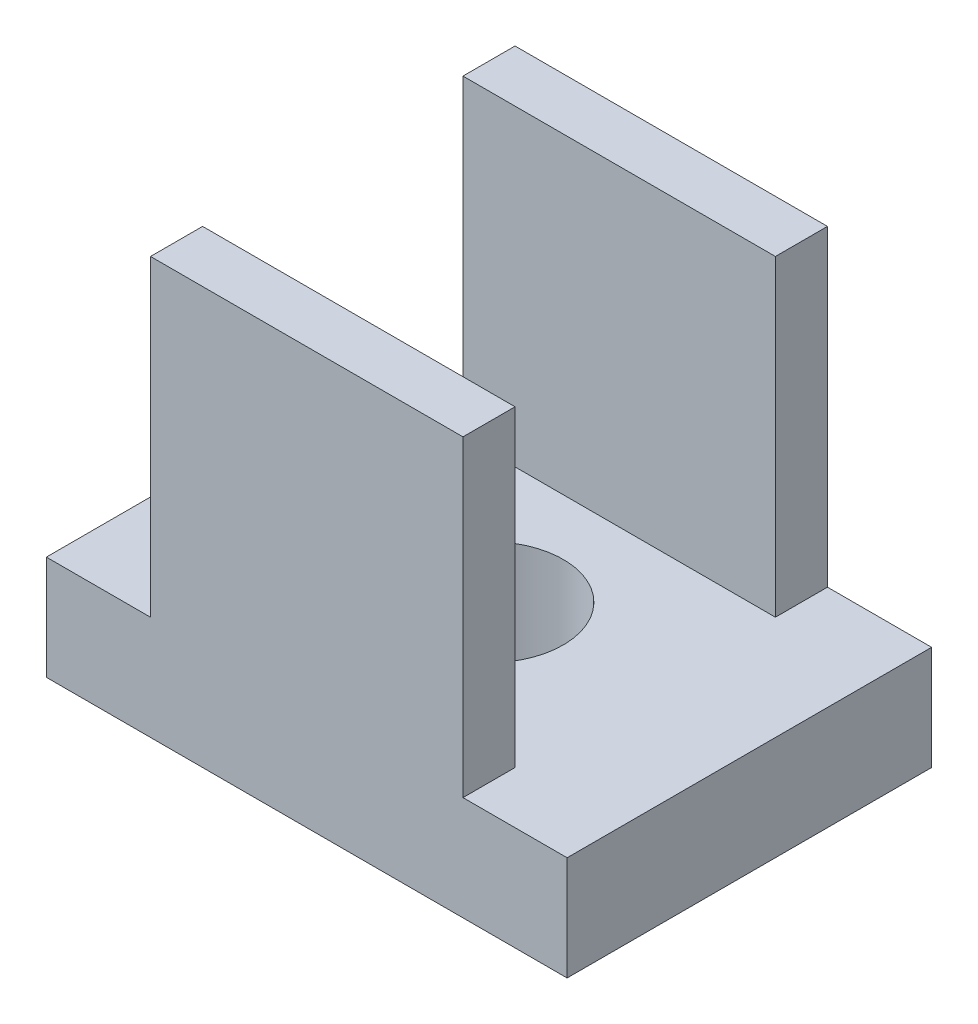
ISO-10303-21;
HEADER;
FILE_DESCRIPTION(('STEP AP214'),'2;1');
FILE_NAME('part.step','',(''),(''),'','','');
FILE_SCHEMA(('AUTOMOTIVE_DESIGN { 1 0 10303 214 1 1 1 1 }'));
ENDSEC;
DATA;
#1=APPLICATION_CONTEXT('core data for automotive mechanical design processes');
#2=APPLICATION_PROTOCOL_DEFINITION('international standard','automotive_design',2000,#1);
#3=PRODUCT_CONTEXT('',#1,'mechanical');
#4=PRODUCT('Part','Part','',(#3));
#5=PRODUCT_RELATED_PRODUCT_CATEGORY('part','',(#4));
#6=PRODUCT_DEFINITION_FORMATION('','',#4);
#7=PRODUCT_DEFINITION_CONTEXT('part definition',#1,'design');
#8=PRODUCT_DEFINITION('design','',#6,#7);
#9=PRODUCT_DEFINITION_SHAPE('','',#8);
#10=(LENGTH_UNIT() NAMED_UNIT(*) SI_UNIT(.MILLI.,.METRE.));
#11=(NAMED_UNIT(*) PLANE_ANGLE_UNIT() SI_UNIT($,.RADIAN.));
#12=(NAMED_UNIT(*) SI_UNIT($,.STERADIAN.) SOLID_ANGLE_UNIT());
#13=UNCERTAINTY_MEASURE_WITH_UNIT(LENGTH_MEASURE(1.E-05),#10,'distance_accuracy_value','');
#14=(GEOMETRIC_REPRESENTATION_CONTEXT(3) GLOBAL_UNCERTAINTY_ASSIGNED_CONTEXT((#13)) GLOBAL_UNIT_ASSIGNED_CONTEXT((#10,
#11,#12)) REPRESENTATION_CONTEXT('',''));
#15=CARTESIAN_POINT('',(0.,0.,0.));
#16=DIRECTION('',(0.,0.,1.));
#17=DIRECTION('',(1.,0.,0.));
#18=AXIS2_PLACEMENT_3D('',#15,#16,#17);
#19=CARTESIAN_POINT('',(0.,2.,0.));
#20=DIRECTION('',(0.,-1.,0.));
#21=DIRECTION('',(0.,0.,-1.));
#22=AXIS2_PLACEMENT_3D('',#19,#20,#21);
#23=PLANE('',#22);
#24=CARTESIAN_POINT('',(0.,2.,0.));
#25=DIRECTION('',(0.,1.,0.));
#26=DIRECTION('',(0.,0.,1.));
#27=AXIS2_PLACEMENT_3D('',#24,#25,#26);
#28=CIRCLE('',#27,1.425);
#29=CARTESIAN_POINT('',(0.,2.,1.425));
#30=VERTEX_POINT('',#29);
#31=EDGE_CURVE('E200',#30,#30,#28,.T.);
#32=ORIENTED_EDGE('',*,*,#31,.F.);
#33=EDGE_LOOP('',(#32));
#34=FACE_BOUND('',#33,.T.);
#35=DIRECTION('',(0.,0.,1.));
#36=VECTOR('',#35,1.);
#37=CARTESIAN_POINT('',(-3.,2.,3.5));
#38=LINE('',#37,#36);
#39=CARTESIAN_POINT('',(-3.,2.,2.5));
#40=VERTEX_POINT('',#39);
#41=CARTESIAN_POINT('',(-3.,2.,3.5));
#42=VERTEX_POINT('',#41);
#43=EDGE_CURVE('E55',#40,#42,#38,.T.);
#44=ORIENTED_EDGE('',*,*,#43,.F.);
#45=DIRECTION('',(-1.,0.,0.));
#46=VECTOR('',#45,1.);
#47=CARTESIAN_POINT('',(-3.,2.,2.5));
#48=LINE('',#47,#46);
#49=CARTESIAN_POINT('',(3.,2.,2.5));
#50=VERTEX_POINT('',#49);
#51=EDGE_CURVE('E59',#50,#40,#48,.T.);
#52=ORIENTED_EDGE('',*,*,#51,.F.);
#53=DIRECTION('',(0.,0.,-1.));
#54=VECTOR('',#53,1.);
#55=CARTESIAN_POINT('',(3.,2.,3.5));
#56=LINE('',#55,#54);
#57=CARTESIAN_POINT('',(3.,2.,3.5));
#58=VERTEX_POINT('',#57);
#59=EDGE_CURVE('E261',#58,#50,#56,.T.);
#60=ORIENTED_EDGE('',*,*,#59,.F.);
#61=DIRECTION('',(1.,0.,0.));
#62=VECTOR('',#61,1.);
#63=CARTESIAN_POINT('',(-5.,2.,3.5));
#64=LINE('',#63,#62);
#65=CARTESIAN_POINT('',(5.,2.,3.5));
#66=VERTEX_POINT('',#65);
#67=EDGE_CURVE('E221',#58,#66,#64,.T.);
#68=ORIENTED_EDGE('',*,*,#67,.T.);
#69=DIRECTION('',(0.,0.,-1.));
#70=VECTOR('',#69,1.);
#71=CARTESIAN_POINT('',(5.,2.,3.5));
#72=LINE('',#71,#70);
#73=CARTESIAN_POINT('',(5.,2.,-3.5));
#74=VERTEX_POINT('',#73);
#75=EDGE_CURVE('E209',#66,#74,#72,.T.);
#76=ORIENTED_EDGE('',*,*,#75,.T.);
#77=DIRECTION('',(-1.,0.,0.));
#78=VECTOR('',#77,1.);
#79=CARTESIAN_POINT('',(-5.,2.,-3.5));
#80=LINE('',#79,#78);
#81=CARTESIAN_POINT('',(3.,2.,-3.5));
#82=VERTEX_POINT('',#81);
#83=EDGE_CURVE('E215',#74,#82,#80,.T.);
#84=ORIENTED_EDGE('',*,*,#83,.T.);
#85=DIRECTION('',(0.,0.,-1.));
#86=VECTOR('',#85,1.);
#87=CARTESIAN_POINT('',(3.,2.,-3.5));
#88=LINE('',#87,#86);
#89=CARTESIAN_POINT('',(3.,2.,-2.5));
#90=VERTEX_POINT('',#89);
#91=EDGE_CURVE('E169',#90,#82,#88,.T.);
#92=ORIENTED_EDGE('',*,*,#91,.F.);
#93=DIRECTION('',(1.,0.,0.));
#94=VECTOR('',#93,1.);
#95=CARTESIAN_POINT('',(-3.,2.,-2.5));
#96=LINE('',#95,#94);
#97=CARTESIAN_POINT('',(-3.,2.,-2.5));
#98=VERTEX_POINT('',#97);
#99=EDGE_CURVE('E158',#98,#90,#96,.T.);
#100=ORIENTED_EDGE('',*,*,#99,.F.);
#101=DIRECTION('',(0.,0.,1.));
#102=VECTOR('',#101,1.);
#103=CARTESIAN_POINT('',(-3.,2.,-3.5));
#104=LINE('',#103,#102);
#105=CARTESIAN_POINT('',(-3.,2.,-3.5));
#106=VERTEX_POINT('',#105);
#107=EDGE_CURVE('E153',#106,#98,#104,.T.);
#108=ORIENTED_EDGE('',*,*,#107,.F.);
#109=CARTESIAN_POINT('',(-5.,2.,-3.5));
#110=VERTEX_POINT('',#109);
#111=EDGE_CURVE('E213',#106,#110,#80,.T.);
#112=ORIENTED_EDGE('',*,*,#111,.T.);
#113=DIRECTION('',(0.,0.,1.));
#114=VECTOR('',#113,1.);
#115=CARTESIAN_POINT('',(-5.,2.,3.5));
#116=LINE('',#115,#114);
#117=CARTESIAN_POINT('',(-5.,2.,3.5));
#118=VERTEX_POINT('',#117);
#119=EDGE_CURVE('E218',#110,#118,#116,.T.);
#120=ORIENTED_EDGE('',*,*,#119,.T.);
#121=EDGE_CURVE('E222',#118,#42,#64,.T.);
#122=ORIENTED_EDGE('',*,*,#121,.T.);
#123=EDGE_LOOP('',(#44,#52,#60,#68,#76,#84,#92,#100,#108,#112,#120,#122));
#124=FACE_BOUND('',#123,.T.);
#125=ADVANCED_FACE('F39',(#34,#124),#23,.F.);
#126=CARTESIAN_POINT('',(5.,2.,3.5));
#127=DIRECTION('',(-1.,0.,0.));
#128=DIRECTION('',(0.,0.,1.));
#129=AXIS2_PLACEMENT_3D('',#126,#127,#128);
#130=PLANE('',#129);
#131=DIRECTION('',(0.,0.,-1.));
#132=VECTOR('',#131,1.);
#133=CARTESIAN_POINT('',(5.,0.,3.5));
#134=LINE('',#133,#132);
#135=CARTESIAN_POINT('',(5.,0.,3.5));
#136=VERTEX_POINT('',#135);
#137=CARTESIAN_POINT('',(5.,0.,-3.5));
#138=VERTEX_POINT('',#137);
#139=EDGE_CURVE('E205',#136,#138,#134,.T.);
#140=ORIENTED_EDGE('',*,*,#139,.T.);
#141=DIRECTION('',(0.,-1.,0.));
#142=VECTOR('',#141,1.);
#143=CARTESIAN_POINT('',(5.,2.,-3.5));
#144=LINE('',#143,#142);
#145=EDGE_CURVE('E11',#74,#138,#144,.T.);
#146=ORIENTED_EDGE('',*,*,#145,.F.);
#147=ORIENTED_EDGE('',*,*,#75,.F.);
#148=DIRECTION('',(0.,-1.,0.));
#149=VECTOR('',#148,1.);
#150=CARTESIAN_POINT('',(5.,2.,3.5));
#151=LINE('',#150,#149);
#152=EDGE_CURVE('E225',#66,#136,#151,.T.);
#153=ORIENTED_EDGE('',*,*,#152,.T.);
#154=EDGE_LOOP('',(#140,#146,#147,#153));
#155=FACE_BOUND('',#154,.T.);
#156=ADVANCED_FACE('F41',(#155),#130,.F.);
#157=CARTESIAN_POINT('',(-5.,2.,-3.5));
#158=DIRECTION('',(0.,0.,1.));
#159=DIRECTION('',(1.,0.,0.));
#160=AXIS2_PLACEMENT_3D('',#157,#158,#159);
#161=PLANE('',#160);
#162=DIRECTION('',(-1.,0.,0.));
#163=VECTOR('',#162,1.);
#164=CARTESIAN_POINT('',(-5.,0.,-3.5));
#165=LINE('',#164,#163);
#166=CARTESIAN_POINT('',(-5.,0.,-3.5));
#167=VERTEX_POINT('',#166);
#168=EDGE_CURVE('E229',#138,#167,#165,.T.);
#169=ORIENTED_EDGE('',*,*,#168,.T.);
#170=DIRECTION('',(0.,-1.,0.));
#171=VECTOR('',#170,1.);
#172=CARTESIAN_POINT('',(-5.,2.,-3.5));
#173=LINE('',#172,#171);
#174=EDGE_CURVE('E48',#110,#167,#173,.T.);
#175=ORIENTED_EDGE('',*,*,#174,.F.);
#176=ORIENTED_EDGE('',*,*,#111,.F.);
#177=DIRECTION('',(0.,-1.,0.));
#178=VECTOR('',#177,1.);
#179=CARTESIAN_POINT('',(-3.,8.,-3.5));
#180=LINE('',#179,#178);
#181=CARTESIAN_POINT('',(-3.,8.,-3.5));
#182=VERTEX_POINT('',#181);
#183=EDGE_CURVE('E177',#182,#106,#180,.T.);
#184=ORIENTED_EDGE('',*,*,#183,.F.);
#185=DIRECTION('',(-1.,0.,0.));
#186=VECTOR('',#185,1.);
#187=CARTESIAN_POINT('',(-3.,8.,-3.5));
#188=LINE('',#187,#186);
#189=CARTESIAN_POINT('',(3.,8.,-3.5));
#190=VERTEX_POINT('',#189);
#191=EDGE_CURVE('E175',#190,#182,#188,.T.);
#192=ORIENTED_EDGE('',*,*,#191,.F.);
#193=DIRECTION('',(0.,-1.,0.));
#194=VECTOR('',#193,1.);
#195=CARTESIAN_POINT('',(3.,8.,-3.5));
#196=LINE('',#195,#194);
#197=EDGE_CURVE('E188',#190,#82,#196,.T.);
#198=ORIENTED_EDGE('',*,*,#197,.T.);
#199=ORIENTED_EDGE('',*,*,#83,.F.);
#200=ORIENTED_EDGE('',*,*,#145,.T.);
#201=EDGE_LOOP('',(#169,#175,#176,#184,#192,#198,#199,#200));
#202=FACE_BOUND('',#201,.T.);
#203=ADVANCED_FACE('F265',(#202),#161,.F.);
#204=CARTESIAN_POINT('',(-5.,2.,3.5));
#205=DIRECTION('',(1.,0.,0.));
#206=DIRECTION('',(0.,0.,-1.));
#207=AXIS2_PLACEMENT_3D('',#204,#205,#206);
#208=PLANE('',#207);
#209=DIRECTION('',(0.,0.,1.));
#210=VECTOR('',#209,1.);
#211=CARTESIAN_POINT('',(-5.,0.,3.5));
#212=LINE('',#211,#210);
#213=CARTESIAN_POINT('',(-5.,0.,3.5));
#214=VERTEX_POINT('',#213);
#215=EDGE_CURVE('E232',#167,#214,#212,.T.);
#216=ORIENTED_EDGE('',*,*,#215,.T.);
#217=DIRECTION('',(0.,-1.,0.));
#218=VECTOR('',#217,1.);
#219=CARTESIAN_POINT('',(-5.,2.,3.5));
#220=LINE('',#219,#218);
#221=EDGE_CURVE('E240',#118,#214,#220,.T.);
#222=ORIENTED_EDGE('',*,*,#221,.F.);
#223=ORIENTED_EDGE('',*,*,#119,.F.);
#224=ORIENTED_EDGE('',*,*,#174,.T.);
#225=EDGE_LOOP('',(#216,#222,#223,#224));
#226=FACE_BOUND('',#225,.T.);
#227=ADVANCED_FACE('F249',(#226),#208,.F.);
#228=CARTESIAN_POINT('',(-5.,2.,3.5));
#229=DIRECTION('',(0.,0.,-1.));
#230=DIRECTION('',(-1.,0.,0.));
#231=AXIS2_PLACEMENT_3D('',#228,#229,#230);
#232=PLANE('',#231);
#233=DIRECTION('',(1.,0.,0.));
#234=VECTOR('',#233,1.);
#235=CARTESIAN_POINT('',(-5.,0.,3.5));
#236=LINE('',#235,#234);
#237=EDGE_CURVE('E214',#214,#136,#236,.T.);
#238=ORIENTED_EDGE('',*,*,#237,.T.);
#239=ORIENTED_EDGE('',*,*,#152,.F.);
#240=ORIENTED_EDGE('',*,*,#67,.F.);
#241=DIRECTION('',(0.,-1.,0.));
#242=VECTOR('',#241,1.);
#243=CARTESIAN_POINT('',(3.,8.,3.5));
#244=LINE('',#243,#242);
#245=CARTESIAN_POINT('',(3.,8.,3.5));
#246=VERTEX_POINT('',#245);
#247=EDGE_CURVE('E135',#246,#58,#244,.T.);
#248=ORIENTED_EDGE('',*,*,#247,.F.);
#249=DIRECTION('',(1.,0.,0.));
#250=VECTOR('',#249,1.);
#251=CARTESIAN_POINT('',(-3.,8.,3.5));
#252=LINE('',#251,#250);
#253=CARTESIAN_POINT('',(-3.,8.,3.5));
#254=VERTEX_POINT('',#253);
#255=EDGE_CURVE('E128',#254,#246,#252,.T.);
#256=ORIENTED_EDGE('',*,*,#255,.F.);
#257=DIRECTION('',(0.,-1.,0.));
#258=VECTOR('',#257,1.);
#259=CARTESIAN_POINT('',(-3.,8.,3.5));
#260=LINE('',#259,#258);
#261=EDGE_CURVE('E133',#254,#42,#260,.T.);
#262=ORIENTED_EDGE('',*,*,#261,.T.);
#263=ORIENTED_EDGE('',*,*,#121,.F.);
#264=ORIENTED_EDGE('',*,*,#221,.T.);
#265=EDGE_LOOP('',(#238,#239,#240,#248,#256,#262,#263,#264));
#266=FACE_BOUND('',#265,.T.);
#267=ADVANCED_FACE('F130',(#266),#232,.F.);
#268=CARTESIAN_POINT('',(0.,0.,0.));
#269=DIRECTION('',(0.,-1.,0.));
#270=DIRECTION('',(0.,0.,-1.));
#271=AXIS2_PLACEMENT_3D('',#268,#269,#270);
#272=PLANE('',#271);
#273=CARTESIAN_POINT('',(0.,0.,0.));
#274=DIRECTION('',(0.,1.,0.));
#275=DIRECTION('',(0.,0.,1.));
#276=AXIS2_PLACEMENT_3D('',#273,#274,#275);
#277=CIRCLE('',#276,1.425);
#278=CARTESIAN_POINT('',(0.,0.,1.425));
#279=VERTEX_POINT('',#278);
#280=EDGE_CURVE('E201',#279,#279,#277,.T.);
#281=ORIENTED_EDGE('',*,*,#280,.T.);
#282=EDGE_LOOP('',(#281));
#283=FACE_BOUND('',#282,.T.);
#284=ORIENTED_EDGE('',*,*,#139,.F.);
#285=ORIENTED_EDGE('',*,*,#237,.F.);
#286=ORIENTED_EDGE('',*,*,#215,.F.);
#287=ORIENTED_EDGE('',*,*,#168,.F.);
#288=EDGE_LOOP('',(#284,#285,#286,#287));
#289=FACE_BOUND('',#288,.T.);
#290=ADVANCED_FACE('F256',(#283,#289),#272,.T.);
#291=CARTESIAN_POINT('',(0.,0.,0.));
#292=DIRECTION('',(0.,1.,0.));
#293=DIRECTION('',(0.,0.,1.));
#294=AXIS2_PLACEMENT_3D('',#291,#292,#293);
#295=CYLINDRICAL_SURFACE('',#294,1.425);
#296=ORIENTED_EDGE('',*,*,#280,.F.);
#297=EDGE_LOOP('',(#296));
#298=FACE_BOUND('',#297,.T.);
#299=ORIENTED_EDGE('',*,*,#31,.T.);
#300=EDGE_LOOP('',(#299));
#301=FACE_BOUND('',#300,.T.);
#302=ADVANCED_FACE('F287',(#298,#301),#295,.F.);
#303=CARTESIAN_POINT('',(-3.,8.,-3.5));
#304=DIRECTION('',(1.,0.,0.));
#305=DIRECTION('',(0.,0.,-1.));
#306=AXIS2_PLACEMENT_3D('',#303,#304,#305);
#307=PLANE('',#306);
#308=ORIENTED_EDGE('',*,*,#107,.T.);
#309=DIRECTION('',(0.,-1.,0.));
#310=VECTOR('',#309,1.);
#311=CARTESIAN_POINT('',(-3.,8.,-2.5));
#312=LINE('',#311,#310);
#313=CARTESIAN_POINT('',(-3.,8.,-2.5));
#314=VERTEX_POINT('',#313);
#315=EDGE_CURVE('E196',#314,#98,#312,.T.);
#316=ORIENTED_EDGE('',*,*,#315,.F.);
#317=DIRECTION('',(0.,0.,1.));
#318=VECTOR('',#317,1.);
#319=CARTESIAN_POINT('',(-3.,8.,-3.5));
#320=LINE('',#319,#318);
#321=EDGE_CURVE('E164',#182,#314,#320,.T.);
#322=ORIENTED_EDGE('',*,*,#321,.F.);
#323=ORIENTED_EDGE('',*,*,#183,.T.);
#324=EDGE_LOOP('',(#308,#316,#322,#323));
#325=FACE_BOUND('',#324,.T.);
#326=ADVANCED_FACE('F269',(#325),#307,.F.);
#327=CARTESIAN_POINT('',(-3.,8.,-2.5));
#328=DIRECTION('',(0.,0.,-1.));
#329=DIRECTION('',(-1.,0.,0.));
#330=AXIS2_PLACEMENT_3D('',#327,#328,#329);
#331=PLANE('',#330);
#332=ORIENTED_EDGE('',*,*,#99,.T.);
#333=DIRECTION('',(0.,-1.,0.));
#334=VECTOR('',#333,1.);
#335=CARTESIAN_POINT('',(3.,8.,-2.5));
#336=LINE('',#335,#334);
#337=CARTESIAN_POINT('',(3.,8.,-2.5));
#338=VERTEX_POINT('',#337);
#339=EDGE_CURVE('E192',#338,#90,#336,.T.);
#340=ORIENTED_EDGE('',*,*,#339,.F.);
#341=DIRECTION('',(1.,0.,0.));
#342=VECTOR('',#341,1.);
#343=CARTESIAN_POINT('',(-3.,8.,-2.5));
#344=LINE('',#343,#342);
#345=EDGE_CURVE('E168',#314,#338,#344,.T.);
#346=ORIENTED_EDGE('',*,*,#345,.F.);
#347=ORIENTED_EDGE('',*,*,#315,.T.);
#348=EDGE_LOOP('',(#332,#340,#346,#347));
#349=FACE_BOUND('',#348,.T.);
#350=ADVANCED_FACE('F279',(#349),#331,.F.);
#351=CARTESIAN_POINT('',(3.,8.,-3.5));
#352=DIRECTION('',(-1.,0.,0.));
#353=DIRECTION('',(0.,0.,1.));
#354=AXIS2_PLACEMENT_3D('',#351,#352,#353);
#355=PLANE('',#354);
#356=ORIENTED_EDGE('',*,*,#91,.T.);
#357=ORIENTED_EDGE('',*,*,#197,.F.);
#358=DIRECTION('',(0.,0.,-1.));
#359=VECTOR('',#358,1.);
#360=CARTESIAN_POINT('',(3.,8.,-3.5));
#361=LINE('',#360,#359);
#362=EDGE_CURVE('E172',#338,#190,#361,.T.);
#363=ORIENTED_EDGE('',*,*,#362,.F.);
#364=ORIENTED_EDGE('',*,*,#339,.T.);
#365=EDGE_LOOP('',(#356,#357,#363,#364));
#366=FACE_BOUND('',#365,.T.);
#367=ADVANCED_FACE('F277',(#366),#355,.F.);
#368=CARTESIAN_POINT('',(0.,8.,0.));
#369=DIRECTION('',(0.,1.,0.));
#370=DIRECTION('',(0.,0.,1.));
#371=AXIS2_PLACEMENT_3D('',#368,#369,#370);
#372=PLANE('',#371);
#373=ORIENTED_EDGE('',*,*,#321,.T.);
#374=ORIENTED_EDGE('',*,*,#345,.T.);
#375=ORIENTED_EDGE('',*,*,#362,.T.);
#376=ORIENTED_EDGE('',*,*,#191,.T.);
#377=EDGE_LOOP('',(#373,#374,#375,#376));
#378=FACE_BOUND('',#377,.T.);
#379=ADVANCED_FACE('F272',(#378),#372,.T.);
#380=CARTESIAN_POINT('',(-3.,8.,3.5));
#381=DIRECTION('',(1.,0.,0.));
#382=DIRECTION('',(0.,0.,-1.));
#383=AXIS2_PLACEMENT_3D('',#380,#381,#382);
#384=PLANE('',#383);
#385=ORIENTED_EDGE('',*,*,#43,.T.);
#386=ORIENTED_EDGE('',*,*,#261,.F.);
#387=DIRECTION('',(0.,0.,1.));
#388=VECTOR('',#387,1.);
#389=CARTESIAN_POINT('',(-3.,8.,3.5));
#390=LINE('',#389,#388);
#391=CARTESIAN_POINT('',(-3.,8.,2.5));
#392=VERTEX_POINT('',#391);
#393=EDGE_CURVE('E140',#392,#254,#390,.T.);
#394=ORIENTED_EDGE('',*,*,#393,.F.);
#395=DIRECTION('',(0.,-1.,0.));
#396=VECTOR('',#395,1.);
#397=CARTESIAN_POINT('',(-3.,8.,2.5));
#398=LINE('',#397,#396);
#399=EDGE_CURVE('E390',#392,#40,#398,.T.);
#400=ORIENTED_EDGE('',*,*,#399,.T.);
#401=EDGE_LOOP('',(#385,#386,#394,#400));
#402=FACE_BOUND('',#401,.T.);
#403=ADVANCED_FACE('F151',(#402),#384,.F.);
#404=CARTESIAN_POINT('',(3.,8.,3.5));
#405=DIRECTION('',(-1.,0.,0.));
#406=DIRECTION('',(0.,0.,1.));
#407=AXIS2_PLACEMENT_3D('',#404,#405,#406);
#408=PLANE('',#407);
#409=ORIENTED_EDGE('',*,*,#59,.T.);
#410=DIRECTION('',(0.,-1.,0.));
#411=VECTOR('',#410,1.);
#412=CARTESIAN_POINT('',(3.,8.,2.5));
#413=LINE('',#412,#411);
#414=CARTESIAN_POINT('',(3.,8.,2.5));
#415=VERTEX_POINT('',#414);
#416=EDGE_CURVE('E160',#415,#50,#413,.T.);
#417=ORIENTED_EDGE('',*,*,#416,.F.);
#418=DIRECTION('',(0.,0.,-1.));
#419=VECTOR('',#418,1.);
#420=CARTESIAN_POINT('',(3.,8.,3.5));
#421=LINE('',#420,#419);
#422=EDGE_CURVE('E139',#246,#415,#421,.T.);
#423=ORIENTED_EDGE('',*,*,#422,.F.);
#424=ORIENTED_EDGE('',*,*,#247,.T.);
#425=EDGE_LOOP('',(#409,#417,#423,#424));
#426=FACE_BOUND('',#425,.T.);
#427=ADVANCED_FACE('F358',(#426),#408,.F.);
#428=CARTESIAN_POINT('',(-3.,8.,2.5));
#429=DIRECTION('',(0.,0.,1.));
#430=DIRECTION('',(1.,0.,0.));
#431=AXIS2_PLACEMENT_3D('',#428,#429,#430);
#432=PLANE('',#431);
#433=ORIENTED_EDGE('',*,*,#51,.T.);
#434=ORIENTED_EDGE('',*,*,#399,.F.);
#435=DIRECTION('',(-1.,0.,0.));
#436=VECTOR('',#435,1.);
#437=CARTESIAN_POINT('',(-3.,8.,2.5));
#438=LINE('',#437,#436);
#439=EDGE_CURVE('E145',#415,#392,#438,.T.);
#440=ORIENTED_EDGE('',*,*,#439,.F.);
#441=ORIENTED_EDGE('',*,*,#416,.T.);
#442=EDGE_LOOP('',(#433,#434,#440,#441));
#443=FACE_BOUND('',#442,.T.);
#444=ADVANCED_FACE('F367',(#443),#432,.F.);
#445=CARTESIAN_POINT('',(0.,8.,0.));
#446=DIRECTION('',(0.,-1.,0.));
#447=DIRECTION('',(0.,0.,-1.));
#448=AXIS2_PLACEMENT_3D('',#445,#446,#447);
#449=PLANE('',#448);
#450=ORIENTED_EDGE('',*,*,#393,.T.);
#451=ORIENTED_EDGE('',*,*,#255,.T.);
#452=ORIENTED_EDGE('',*,*,#422,.T.);
#453=ORIENTED_EDGE('',*,*,#439,.T.);
#454=EDGE_LOOP('',(#450,#451,#452,#453));
#455=FACE_BOUND('',#454,.T.);
#456=ADVANCED_FACE('F143',(#455),#449,.F.);
#457=CLOSED_SHELL('',(#125,#156,#203,#227,#267,#290,#302,#326,#350,#367,#379,#403,#427,#444,#456));
#458=MANIFOLD_SOLID_BREP('B2',#457);
#459=ADVANCED_BREP_SHAPE_REPRESENTATION('',(#18,#458),#14);
#460=SHAPE_DEFINITION_REPRESENTATION(#9,#459);
ENDSEC;
END-ISO-10303-21;
